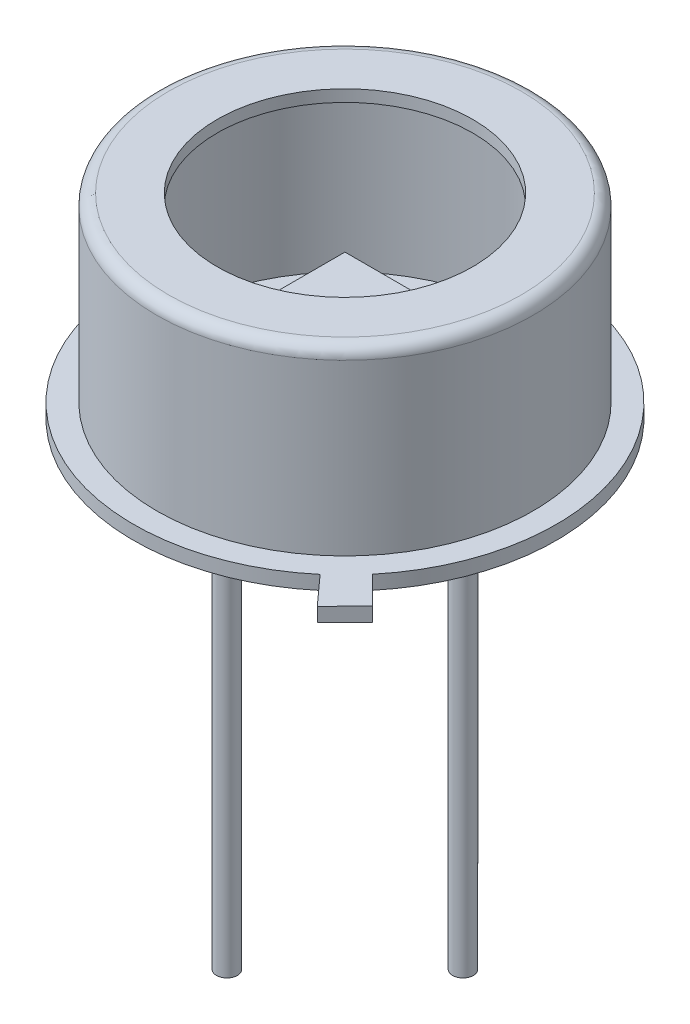
ISO-10303-21;
HEADER;
FILE_DESCRIPTION(('STEP AP214'),'2;1');
FILE_NAME('part.step','',(''),(''),'','','');
FILE_SCHEMA(('AUTOMOTIVE_DESIGN { 1 0 10303 214 1 1 1 1 }'));
ENDSEC;
DATA;
#1=APPLICATION_CONTEXT('core data for automotive mechanical design processes');
#2=APPLICATION_PROTOCOL_DEFINITION('international standard','automotive_design',2000,#1);
#3=PRODUCT_CONTEXT('',#1,'mechanical');
#4=PRODUCT('Part','Part','',(#3));
#5=PRODUCT_RELATED_PRODUCT_CATEGORY('part','',(#4));
#6=PRODUCT_DEFINITION_FORMATION('','',#4);
#7=PRODUCT_DEFINITION_CONTEXT('part definition',#1,'design');
#8=PRODUCT_DEFINITION('design','',#6,#7);
#9=PRODUCT_DEFINITION_SHAPE('','',#8);
#10=(LENGTH_UNIT() NAMED_UNIT(*) SI_UNIT(.MILLI.,.METRE.));
#11=(NAMED_UNIT(*) PLANE_ANGLE_UNIT() SI_UNIT($,.RADIAN.));
#12=(NAMED_UNIT(*) SI_UNIT($,.STERADIAN.) SOLID_ANGLE_UNIT());
#13=UNCERTAINTY_MEASURE_WITH_UNIT(LENGTH_MEASURE(1.E-05),#10,'distance_accuracy_value','');
#14=(GEOMETRIC_REPRESENTATION_CONTEXT(3) GLOBAL_UNCERTAINTY_ASSIGNED_CONTEXT((#13)) GLOBAL_UNIT_ASSIGNED_CONTEXT((#10,
#11,#12)) REPRESENTATION_CONTEXT('',''));
#15=CARTESIAN_POINT('',(0.,0.,0.));
#16=DIRECTION('',(0.,0.,1.));
#17=DIRECTION('',(1.,0.,0.));
#18=AXIS2_PLACEMENT_3D('',#15,#16,#17);
#19=CARTESIAN_POINT('',(-1.,1.592,1.));
#20=DIRECTION('',(1.,0.,0.));
#21=DIRECTION('',(0.,0.,-1.));
#22=AXIS2_PLACEMENT_3D('',#19,#20,#21);
#23=PLANE('',#22);
#24=DIRECTION('',(0.,0.,-1.));
#25=VECTOR('',#24,1.);
#26=CARTESIAN_POINT('',(-1.,2.1,1.));
#27=LINE('',#26,#25);
#28=CARTESIAN_POINT('',(-1.,2.1,1.));
#29=VERTEX_POINT('',#28);
#30=CARTESIAN_POINT('',(-1.,2.1,-1.));
#31=VERTEX_POINT('',#30);
#32=EDGE_CURVE('E108',#29,#31,#27,.T.);
#33=ORIENTED_EDGE('',*,*,#32,.T.);
#34=DIRECTION('',(0.,1.,0.));
#35=VECTOR('',#34,1.);
#36=CARTESIAN_POINT('',(-1.,1.592,-1.));
#37=LINE('',#36,#35);
#38=CARTESIAN_POINT('',(-1.,1.592,-1.));
#39=VERTEX_POINT('',#38);
#40=EDGE_CURVE('E12',#39,#31,#37,.T.);
#41=ORIENTED_EDGE('',*,*,#40,.F.);
#42=DIRECTION('',(0.,0.,-1.));
#43=VECTOR('',#42,1.);
#44=CARTESIAN_POINT('',(-1.,1.592,1.));
#45=LINE('',#44,#43);
#46=CARTESIAN_POINT('',(-1.,1.592,1.));
#47=VERTEX_POINT('',#46);
#48=EDGE_CURVE('E96',#47,#39,#45,.T.);
#49=ORIENTED_EDGE('',*,*,#48,.F.);
#50=DIRECTION('',(0.,1.,0.));
#51=VECTOR('',#50,1.);
#52=CARTESIAN_POINT('',(-1.,1.592,1.));
#53=LINE('',#52,#51);
#54=EDGE_CURVE('E104',#47,#29,#53,.T.);
#55=ORIENTED_EDGE('',*,*,#54,.T.);
#56=EDGE_LOOP('',(#33,#41,#49,#55));
#57=FACE_BOUND('',#56,.T.);
#58=ADVANCED_FACE('F45',(#57),#23,.F.);
#59=CARTESIAN_POINT('',(-1.,1.592,-1.));
#60=DIRECTION('',(0.,0.,1.));
#61=DIRECTION('',(1.,0.,0.));
#62=AXIS2_PLACEMENT_3D('',#59,#60,#61);
#63=PLANE('',#62);
#64=DIRECTION('',(1.,0.,0.));
#65=VECTOR('',#64,1.);
#66=CARTESIAN_POINT('',(-1.,2.1,-1.));
#67=LINE('',#66,#65);
#68=CARTESIAN_POINT('',(1.,2.1,-1.));
#69=VERTEX_POINT('',#68);
#70=EDGE_CURVE('E100',#31,#69,#67,.T.);
#71=ORIENTED_EDGE('',*,*,#70,.T.);
#72=DIRECTION('',(0.,1.,0.));
#73=VECTOR('',#72,1.);
#74=CARTESIAN_POINT('',(1.,1.592,-1.));
#75=LINE('',#74,#73);
#76=CARTESIAN_POINT('',(1.,1.592,-1.));
#77=VERTEX_POINT('',#76);
#78=EDGE_CURVE('E53',#77,#69,#75,.T.);
#79=ORIENTED_EDGE('',*,*,#78,.F.);
#80=DIRECTION('',(1.,0.,0.));
#81=VECTOR('',#80,1.);
#82=CARTESIAN_POINT('',(-1.,1.592,-1.));
#83=LINE('',#82,#81);
#84=EDGE_CURVE('E91',#39,#77,#83,.T.);
#85=ORIENTED_EDGE('',*,*,#84,.F.);
#86=ORIENTED_EDGE('',*,*,#40,.T.);
#87=EDGE_LOOP('',(#71,#79,#85,#86));
#88=FACE_BOUND('',#87,.T.);
#89=ADVANCED_FACE('F99',(#88),#63,.F.);
#90=CARTESIAN_POINT('',(1.,1.592,1.));
#91=DIRECTION('',(-1.,0.,0.));
#92=DIRECTION('',(0.,0.,1.));
#93=AXIS2_PLACEMENT_3D('',#90,#91,#92);
#94=PLANE('',#93);
#95=DIRECTION('',(0.,0.,1.));
#96=VECTOR('',#95,1.);
#97=CARTESIAN_POINT('',(1.,2.1,1.));
#98=LINE('',#97,#96);
#99=CARTESIAN_POINT('',(1.,2.1,1.));
#100=VERTEX_POINT('',#99);
#101=EDGE_CURVE('E78',#69,#100,#98,.T.);
#102=ORIENTED_EDGE('',*,*,#101,.T.);
#103=DIRECTION('',(0.,1.,0.));
#104=VECTOR('',#103,1.);
#105=CARTESIAN_POINT('',(1.,1.592,1.));
#106=LINE('',#105,#104);
#107=CARTESIAN_POINT('',(1.,1.592,1.));
#108=VERTEX_POINT('',#107);
#109=EDGE_CURVE('E101',#108,#100,#106,.T.);
#110=ORIENTED_EDGE('',*,*,#109,.F.);
#111=DIRECTION('',(0.,0.,1.));
#112=VECTOR('',#111,1.);
#113=CARTESIAN_POINT('',(1.,1.592,1.));
#114=LINE('',#113,#112);
#115=EDGE_CURVE('E94',#77,#108,#114,.T.);
#116=ORIENTED_EDGE('',*,*,#115,.F.);
#117=ORIENTED_EDGE('',*,*,#78,.T.);
#118=EDGE_LOOP('',(#102,#110,#116,#117));
#119=FACE_BOUND('',#118,.T.);
#120=ADVANCED_FACE('F102',(#119),#94,.F.);
#121=CARTESIAN_POINT('',(-1.,1.592,1.));
#122=DIRECTION('',(0.,0.,-1.));
#123=DIRECTION('',(-1.,0.,0.));
#124=AXIS2_PLACEMENT_3D('',#121,#122,#123);
#125=PLANE('',#124);
#126=DIRECTION('',(-1.,0.,0.));
#127=VECTOR('',#126,1.);
#128=CARTESIAN_POINT('',(-1.,2.1,1.));
#129=LINE('',#128,#127);
#130=EDGE_CURVE('E84',#100,#29,#129,.T.);
#131=ORIENTED_EDGE('',*,*,#130,.T.);
#132=ORIENTED_EDGE('',*,*,#54,.F.);
#133=DIRECTION('',(-1.,0.,0.));
#134=VECTOR('',#133,1.);
#135=CARTESIAN_POINT('',(-1.,1.592,1.));
#136=LINE('',#135,#134);
#137=EDGE_CURVE('E61',#108,#47,#136,.T.);
#138=ORIENTED_EDGE('',*,*,#137,.F.);
#139=ORIENTED_EDGE('',*,*,#109,.T.);
#140=EDGE_LOOP('',(#131,#132,#138,#139));
#141=FACE_BOUND('',#140,.T.);
#142=ADVANCED_FACE('F115',(#141),#125,.F.);
#143=CARTESIAN_POINT('',(-1.,1.592,-1.));
#144=DIRECTION('',(0.,-1.,0.));
#145=DIRECTION('',(0.,0.,-1.));
#146=AXIS2_PLACEMENT_3D('',#143,#144,#145);
#147=PLANE('',#146);
#148=ORIENTED_EDGE('',*,*,#48,.T.);
#149=ORIENTED_EDGE('',*,*,#84,.T.);
#150=ORIENTED_EDGE('',*,*,#115,.T.);
#151=ORIENTED_EDGE('',*,*,#137,.T.);
#152=EDGE_LOOP('',(#148,#149,#150,#151));
#153=FACE_BOUND('',#152,.T.);
#154=ADVANCED_FACE('F92',(#153),#147,.T.);
#155=CARTESIAN_POINT('',(-1.,2.1,-1.));
#156=DIRECTION('',(0.,-1.,0.));
#157=DIRECTION('',(0.,0.,-1.));
#158=AXIS2_PLACEMENT_3D('',#155,#156,#157);
#159=PLANE('',#158);
#160=ORIENTED_EDGE('',*,*,#32,.F.);
#161=ORIENTED_EDGE('',*,*,#130,.F.);
#162=ORIENTED_EDGE('',*,*,#101,.F.);
#163=ORIENTED_EDGE('',*,*,#70,.F.);
#164=EDGE_LOOP('',(#160,#161,#162,#163));
#165=FACE_BOUND('',#164,.T.);
#166=ADVANCED_FACE('F118',(#165),#159,.F.);
#167=CLOSED_SHELL('',(#58,#89,#120,#142,#154,#166));
#168=MANIFOLD_SOLID_BREP('B2',#167);
#169=CARTESIAN_POINT('',(4.55,0.,0.));
#170=DIRECTION('',(0.,1.,0.));
#171=DIRECTION('',(0.,0.,1.));
#172=AXIS2_PLACEMENT_3D('',#169,#170,#171);
#173=PLANE('',#172);
#174=CARTESIAN_POINT('',(2.54,0.,0.));
#175=DIRECTION('',(0.,1.,0.));
#176=DIRECTION('',(0.,0.,1.));
#177=AXIS2_PLACEMENT_3D('',#174,#175,#176);
#178=CIRCLE('',#177,0.225000000000001);
#179=CARTESIAN_POINT('',(2.54,0.,0.225000000000001));
#180=VERTEX_POINT('',#179);
#181=EDGE_CURVE('E179',#180,#180,#178,.F.);
#182=ORIENTED_EDGE('',*,*,#181,.F.);
#183=EDGE_LOOP('',(#182));
#184=FACE_BOUND('',#183,.T.);
#185=CARTESIAN_POINT('',(-2.54,0.,0.));
#186=DIRECTION('',(0.,1.,0.));
#187=DIRECTION('',(0.,0.,1.));
#188=AXIS2_PLACEMENT_3D('',#185,#186,#187);
#189=CIRCLE('',#188,0.224999999999999);
#190=CARTESIAN_POINT('',(-2.54,0.,0.224999999999999));
#191=VERTEX_POINT('',#190);
#192=EDGE_CURVE('E269',#191,#191,#189,.F.);
#193=ORIENTED_EDGE('',*,*,#192,.F.);
#194=EDGE_LOOP('',(#193));
#195=FACE_BOUND('',#194,.T.);
#196=CARTESIAN_POINT('',(0.,0.,0.));
#197=DIRECTION('',(0.,-1.,0.));
#198=DIRECTION('',(0.,0.,-1.));
#199=AXIS2_PLACEMENT_3D('',#196,#197,#198);
#200=CIRCLE('',#199,4.55);
#201=CARTESIAN_POINT('',(2.93886579784095,0.,3.47355262264453));
#202=VERTEX_POINT('',#201);
#203=CARTESIAN_POINT('',(3.4991505641407,0.,2.90834064880197));
#204=VERTEX_POINT('',#203);
#205=EDGE_CURVE('E186',#202,#204,#200,.T.);
#206=ORIENTED_EDGE('',*,*,#205,.T.);
#207=DIRECTION('',(0.710195552739869,0.,0.70400445798909));
#208=VECTOR('',#207,1.);
#209=CARTESIAN_POINT('',(3.4991505641407,0.,2.90834064880197));
#210=LINE('',#209,#208);
#211=CARTESIAN_POINT('',(4.09684665660265,0.,3.50082635501703));
#212=VERTEX_POINT('',#211);
#213=EDGE_CURVE('E239',#204,#212,#210,.T.);
#214=ORIENTED_EDGE('',*,*,#213,.T.);
#215=DIRECTION('',(-0.70400445798909,0.,0.710195552739869));
#216=VECTOR('',#215,1.);
#217=CARTESIAN_POINT('',(4.09684665660265,0.,3.50082635501703));
#218=LINE('',#217,#216);
#219=CARTESIAN_POINT('',(3.50343561688417,0.,4.09945591846979));
#220=VERTEX_POINT('',#219);
#221=EDGE_CURVE('E235',#212,#220,#218,.T.);
#222=ORIENTED_EDGE('',*,*,#221,.T.);
#223=DIRECTION('',(-0.669788128042024,0.,-0.742552263166682));
#224=VECTOR('',#223,1.);
#225=CARTESIAN_POINT('',(3.50343561688417,0.,4.09945591846979));
#226=LINE('',#225,#224);
#227=EDGE_CURVE('E226',#220,#202,#226,.T.);
#228=ORIENTED_EDGE('',*,*,#227,.T.);
#229=EDGE_LOOP('',(#206,#214,#222,#228));
#230=FACE_BOUND('',#229,.T.);
#231=CARTESIAN_POINT('',(0.,0.,2.54));
#232=DIRECTION('',(0.,1.,0.));
#233=DIRECTION('',(0.,0.,1.));
#234=AXIS2_PLACEMENT_3D('',#231,#232,#233);
#235=CIRCLE('',#234,0.75);
#236=CARTESIAN_POINT('',(0.,0.,3.29));
#237=VERTEX_POINT('',#236);
#238=EDGE_CURVE('E43',#237,#237,#235,.F.);
#239=ORIENTED_EDGE('',*,*,#238,.F.);
#240=EDGE_LOOP('',(#239));
#241=FACE_BOUND('',#240,.T.);
#242=ADVANCED_FACE('F171',(#184,#195,#230,#241),#173,.F.);
#243=CARTESIAN_POINT('',(3.796,4.2,0.));
#244=DIRECTION('',(0.,1.,0.));
#245=DIRECTION('',(0.,0.,1.));
#246=AXIS2_PLACEMENT_3D('',#243,#244,#245);
#247=PLANE('',#246);
#248=CARTESIAN_POINT('',(0.,4.2,0.));
#249=DIRECTION('',(0.,-1.,0.));
#250=DIRECTION('',(0.,0.,-1.));
#251=AXIS2_PLACEMENT_3D('',#248,#249,#250);
#252=CIRCLE('',#251,2.75);
#253=CARTESIAN_POINT('',(0.,4.2,-2.75));
#254=VERTEX_POINT('',#253);
#255=EDGE_CURVE('E266',#254,#254,#252,.T.);
#256=ORIENTED_EDGE('',*,*,#255,.T.);
#257=EDGE_LOOP('',(#256));
#258=FACE_BOUND('',#257,.T.);
#259=CARTESIAN_POINT('',(0.,4.2,0.));
#260=DIRECTION('',(0.,-1.,0.));
#261=DIRECTION('',(0.,0.,-1.));
#262=AXIS2_PLACEMENT_3D('',#259,#260,#261);
#263=CIRCLE('',#262,3.796);
#264=CARTESIAN_POINT('',(0.,4.2,-3.796));
#265=VERTEX_POINT('',#264);
#266=EDGE_CURVE('E249',#265,#265,#263,.T.);
#267=ORIENTED_EDGE('',*,*,#266,.F.);
#268=EDGE_LOOP('',(#267));
#269=FACE_BOUND('',#268,.T.);
#270=ADVANCED_FACE('F173',(#258,#269),#247,.T.);
#271=CARTESIAN_POINT('',(0.,0.,0.));
#272=DIRECTION('',(0.,-1.,0.));
#273=DIRECTION('',(0.,0.,-1.));
#274=AXIS2_PLACEMENT_3D('',#271,#272,#273);
#275=CYLINDRICAL_SURFACE('',#274,2.75);
#276=ORIENTED_EDGE('',*,*,#255,.F.);
#277=EDGE_LOOP('',(#276));
#278=FACE_BOUND('',#277,.T.);
#279=CARTESIAN_POINT('',(0.,3.946,0.));
#280=DIRECTION('',(0.,-1.,0.));
#281=DIRECTION('',(0.,0.,-1.));
#282=AXIS2_PLACEMENT_3D('',#279,#280,#281);
#283=CIRCLE('',#282,2.75);
#284=CARTESIAN_POINT('',(0.,3.946,-2.75));
#285=VERTEX_POINT('',#284);
#286=EDGE_CURVE('E263',#285,#285,#283,.T.);
#287=ORIENTED_EDGE('',*,*,#286,.T.);
#288=EDGE_LOOP('',(#287));
#289=FACE_BOUND('',#288,.T.);
#290=ADVANCED_FACE('F314',(#278,#289),#275,.F.);
#291=CARTESIAN_POINT('',(3.796,3.946,0.));
#292=DIRECTION('',(0.,1.,0.));
#293=DIRECTION('',(0.,0.,1.));
#294=AXIS2_PLACEMENT_3D('',#291,#292,#293);
#295=PLANE('',#294);
#296=ORIENTED_EDGE('',*,*,#286,.F.);
#297=EDGE_LOOP('',(#296));
#298=FACE_BOUND('',#297,.T.);
#299=CARTESIAN_POINT('',(0.,3.946,0.));
#300=DIRECTION('',(0.,-1.,0.));
#301=DIRECTION('',(0.,0.,-1.));
#302=AXIS2_PLACEMENT_3D('',#299,#300,#301);
#303=CIRCLE('',#302,3.796);
#304=CARTESIAN_POINT('',(0.,3.946,-3.796));
#305=VERTEX_POINT('',#304);
#306=EDGE_CURVE('E260',#305,#305,#303,.T.);
#307=ORIENTED_EDGE('',*,*,#306,.T.);
#308=EDGE_LOOP('',(#307));
#309=FACE_BOUND('',#308,.T.);
#310=ADVANCED_FACE('F325',(#298,#309),#295,.F.);
#311=CARTESIAN_POINT('',(0.,0.,0.));
#312=DIRECTION('',(0.,-1.,0.));
#313=DIRECTION('',(0.,0.,-1.));
#314=AXIS2_PLACEMENT_3D('',#311,#312,#313);
#315=CYLINDRICAL_SURFACE('',#314,3.796);
#316=ORIENTED_EDGE('',*,*,#306,.F.);
#317=EDGE_LOOP('',(#316));
#318=FACE_BOUND('',#317,.T.);
#319=CARTESIAN_POINT('',(0.,0.0459999999999999,0.));
#320=DIRECTION('',(0.,1.,0.));
#321=DIRECTION('',(0.,0.,1.));
#322=AXIS2_PLACEMENT_3D('',#319,#320,#321);
#323=CIRCLE('',#322,3.796);
#324=CARTESIAN_POINT('',(0.,0.0459999999999999,3.796));
#325=VERTEX_POINT('',#324);
#326=EDGE_CURVE('E246',#325,#325,#323,.F.);
#327=ORIENTED_EDGE('',*,*,#326,.T.);
#328=EDGE_LOOP('',(#327));
#329=FACE_BOUND('',#328,.T.);
#330=ADVANCED_FACE('F322',(#318,#329),#315,.F.);
#331=CARTESIAN_POINT('',(0.,0.,0.));
#332=DIRECTION('',(0.,-1.,0.));
#333=DIRECTION('',(0.,0.,-1.));
#334=AXIS2_PLACEMENT_3D('',#331,#332,#333);
#335=CYLINDRICAL_SURFACE('',#334,4.55);
#336=DIRECTION('',(0.,-1.,0.));
#337=VECTOR('',#336,1.);
#338=CARTESIAN_POINT('',(2.93886579784096,1.96122703291704,3.47355262264452));
#339=LINE('',#338,#337);
#340=CARTESIAN_POINT('',(2.93886579784097,0.3,3.47355262264451));
#341=VERTEX_POINT('',#340);
#342=EDGE_CURVE('E220',#341,#202,#339,.T.);
#343=ORIENTED_EDGE('',*,*,#342,.F.);
#344=CARTESIAN_POINT('',(0.,0.3,0.));
#345=DIRECTION('',(0.,-1.,0.));
#346=DIRECTION('',(0.,0.,-1.));
#347=AXIS2_PLACEMENT_3D('',#344,#345,#346);
#348=CIRCLE('',#347,4.55);
#349=CARTESIAN_POINT('',(3.4991505641407,0.3,2.90834064880197));
#350=VERTEX_POINT('',#349);
#351=EDGE_CURVE('E218',#341,#350,#348,.T.);
#352=ORIENTED_EDGE('',*,*,#351,.T.);
#353=DIRECTION('',(0.,-1.,0.));
#354=VECTOR('',#353,1.);
#355=CARTESIAN_POINT('',(3.4991505641407,1.96122703291704,2.90834064880197));
#356=LINE('',#355,#354);
#357=EDGE_CURVE('E191',#350,#204,#356,.T.);
#358=ORIENTED_EDGE('',*,*,#357,.T.);
#359=ORIENTED_EDGE('',*,*,#205,.F.);
#360=EDGE_LOOP('',(#343,#352,#358,#359));
#361=FACE_BOUND('',#360,.T.);
#362=ADVANCED_FACE('F320',(#361),#335,.T.);
#363=CARTESIAN_POINT('',(4.55,0.3,0.));
#364=DIRECTION('',(0.,1.,0.));
#365=DIRECTION('',(0.,0.,1.));
#366=AXIS2_PLACEMENT_3D('',#363,#364,#365);
#367=PLANE('',#366);
#368=ORIENTED_EDGE('',*,*,#351,.F.);
#369=DIRECTION('',(-0.669788128042024,0.,-0.742552263166682));
#370=VECTOR('',#369,1.);
#371=CARTESIAN_POINT('',(3.50343561688417,0.3,4.09945591846979));
#372=LINE('',#371,#370);
#373=CARTESIAN_POINT('',(3.50343561688417,0.3,4.09945591846979));
#374=VERTEX_POINT('',#373);
#375=EDGE_CURVE('E210',#374,#341,#372,.T.);
#376=ORIENTED_EDGE('',*,*,#375,.F.);
#377=DIRECTION('',(-0.70400445798909,0.,0.710195552739869));
#378=VECTOR('',#377,1.);
#379=CARTESIAN_POINT('',(4.09684665660265,0.3,3.50082635501703));
#380=LINE('',#379,#378);
#381=CARTESIAN_POINT('',(4.09684665660265,0.3,3.50082635501703));
#382=VERTEX_POINT('',#381);
#383=EDGE_CURVE('E216',#382,#374,#380,.T.);
#384=ORIENTED_EDGE('',*,*,#383,.F.);
#385=DIRECTION('',(0.710195552739869,0.,0.70400445798909));
#386=VECTOR('',#385,1.);
#387=CARTESIAN_POINT('',(3.4991505641407,0.3,2.90834064880197));
#388=LINE('',#387,#386);
#389=EDGE_CURVE('E241',#350,#382,#388,.T.);
#390=ORIENTED_EDGE('',*,*,#389,.F.);
#391=EDGE_LOOP('',(#368,#376,#384,#390));
#392=FACE_BOUND('',#391,.T.);
#393=CARTESIAN_POINT('',(0.,0.3,0.));
#394=DIRECTION('',(0.,-1.,0.));
#395=DIRECTION('',(0.,0.,-1.));
#396=AXIS2_PLACEMENT_3D('',#393,#394,#395);
#397=CIRCLE('',#396,4.05);
#398=CARTESIAN_POINT('',(0.,0.3,-4.05));
#399=VERTEX_POINT('',#398);
#400=EDGE_CURVE('E255',#399,#399,#397,.T.);
#401=ORIENTED_EDGE('',*,*,#400,.T.);
#402=EDGE_LOOP('',(#401));
#403=FACE_BOUND('',#402,.T.);
#404=ADVANCED_FACE('F212',(#392,#403),#367,.T.);
#405=CARTESIAN_POINT('',(0.,0.,0.));
#406=DIRECTION('',(0.,-1.,0.));
#407=DIRECTION('',(0.,0.,-1.));
#408=AXIS2_PLACEMENT_3D('',#405,#406,#407);
#409=CYLINDRICAL_SURFACE('',#408,4.05);
#410=CARTESIAN_POINT('',(0.,3.946,0.));
#411=DIRECTION('',(0.,-1.,0.));
#412=DIRECTION('',(0.,0.,-1.));
#413=AXIS2_PLACEMENT_3D('',#410,#411,#412);
#414=CIRCLE('',#413,4.05);
#415=CARTESIAN_POINT('',(0.,3.946,-4.05));
#416=VERTEX_POINT('',#415);
#417=EDGE_CURVE('E252',#416,#416,#414,.T.);
#418=ORIENTED_EDGE('',*,*,#417,.T.);
#419=EDGE_LOOP('',(#418));
#420=FACE_BOUND('',#419,.T.);
#421=ORIENTED_EDGE('',*,*,#400,.F.);
#422=EDGE_LOOP('',(#421));
#423=FACE_BOUND('',#422,.T.);
#424=ADVANCED_FACE('F350',(#420,#423),#409,.T.);
#425=CARTESIAN_POINT('',(0.,3.946,0.));
#426=DIRECTION('',(0.,-1.,0.));
#427=DIRECTION('',(0.,0.,-1.));
#428=AXIS2_PLACEMENT_3D('',#425,#426,#427);
#429=TOROIDAL_SURFACE('',#428,3.796,0.253999999999999);
#430=ORIENTED_EDGE('',*,*,#266,.T.);
#431=EDGE_LOOP('',(#430));
#432=FACE_BOUND('',#431,.T.);
#433=ORIENTED_EDGE('',*,*,#417,.F.);
#434=EDGE_LOOP('',(#433));
#435=FACE_BOUND('',#434,.T.);
#436=ADVANCED_FACE('F343',(#432,#435),#429,.T.);
#437=CARTESIAN_POINT('',(4.55,0.0459999999999999,0.));
#438=DIRECTION('',(0.,1.,0.));
#439=DIRECTION('',(0.,0.,1.));
#440=AXIS2_PLACEMENT_3D('',#437,#438,#439);
#441=PLANE('',#440);
#442=ORIENTED_EDGE('',*,*,#326,.F.);
#443=EDGE_LOOP('',(#442));
#444=FACE_BOUND('',#443,.T.);
#445=ADVANCED_FACE('F341',(#444),#441,.T.);
#446=CARTESIAN_POINT('',(4.09684665660265,1.96122703291704,3.50082635501703));
#447=DIRECTION('',(0.710195552739869,0.,0.70400445798909));
#448=DIRECTION('',(0.70400445798909,0.,-0.710195552739869));
#449=AXIS2_PLACEMENT_3D('',#446,#447,#448);
#450=PLANE('',#449);
#451=DIRECTION('',(0.,-1.,0.));
#452=VECTOR('',#451,1.);
#453=CARTESIAN_POINT('',(4.09684665660265,1.96122703291704,3.50082635501703));
#454=LINE('',#453,#452);
#455=EDGE_CURVE('E233',#382,#212,#454,.T.);
#456=ORIENTED_EDGE('',*,*,#455,.F.);
#457=ORIENTED_EDGE('',*,*,#383,.T.);
#458=DIRECTION('',(0.,-1.,0.));
#459=VECTOR('',#458,1.);
#460=CARTESIAN_POINT('',(3.50343561688417,1.96122703291704,4.09945591846979));
#461=LINE('',#460,#459);
#462=EDGE_CURVE('E221',#374,#220,#461,.T.);
#463=ORIENTED_EDGE('',*,*,#462,.T.);
#464=ORIENTED_EDGE('',*,*,#221,.F.);
#465=EDGE_LOOP('',(#456,#457,#463,#464));
#466=FACE_BOUND('',#465,.T.);
#467=ADVANCED_FACE('F232',(#466),#450,.T.);
#468=CARTESIAN_POINT('',(3.50343561688417,1.96122703291704,4.09945591846979));
#469=DIRECTION('',(-0.742552263166682,0.,0.669788128042024));
#470=DIRECTION('',(0.669788128042024,0.,0.742552263166682));
#471=AXIS2_PLACEMENT_3D('',#468,#469,#470);
#472=PLANE('',#471);
#473=ORIENTED_EDGE('',*,*,#462,.F.);
#474=ORIENTED_EDGE('',*,*,#375,.T.);
#475=ORIENTED_EDGE('',*,*,#342,.T.);
#476=ORIENTED_EDGE('',*,*,#227,.F.);
#477=EDGE_LOOP('',(#473,#474,#475,#476));
#478=FACE_BOUND('',#477,.T.);
#479=ADVANCED_FACE('F224',(#478),#472,.T.);
#480=CARTESIAN_POINT('',(3.4991505641407,1.96122703291704,2.90834064880197));
#481=DIRECTION('',(0.70400445798909,0.,-0.710195552739869));
#482=DIRECTION('',(-0.710195552739869,0.,-0.70400445798909));
#483=AXIS2_PLACEMENT_3D('',#480,#481,#482);
#484=PLANE('',#483);
#485=ORIENTED_EDGE('',*,*,#357,.F.);
#486=ORIENTED_EDGE('',*,*,#389,.T.);
#487=ORIENTED_EDGE('',*,*,#455,.T.);
#488=ORIENTED_EDGE('',*,*,#213,.F.);
#489=EDGE_LOOP('',(#485,#486,#487,#488));
#490=FACE_BOUND('',#489,.T.);
#491=ADVANCED_FACE('F296',(#490),#484,.T.);
#492=CARTESIAN_POINT('',(-2.54,-9.,0.));
#493=DIRECTION('',(0.,1.,0.));
#494=DIRECTION('',(0.,0.,1.));
#495=AXIS2_PLACEMENT_3D('',#492,#493,#494);
#496=CYLINDRICAL_SURFACE('',#495,0.224999999999999);
#497=CARTESIAN_POINT('',(-2.54,-9.,0.));
#498=DIRECTION('',(0.,-1.,0.));
#499=DIRECTION('',(0.,0.,-1.));
#500=AXIS2_PLACEMENT_3D('',#497,#498,#499);
#501=CIRCLE('',#500,0.224999999999999);
#502=CARTESIAN_POINT('',(-2.54,-9.,-0.224999999999999));
#503=VERTEX_POINT('',#502);
#504=EDGE_CURVE('E289',#503,#503,#501,.T.);
#505=ORIENTED_EDGE('',*,*,#504,.F.);
#506=EDGE_LOOP('',(#505));
#507=FACE_BOUND('',#506,.T.);
#508=ORIENTED_EDGE('',*,*,#192,.T.);
#509=EDGE_LOOP('',(#508));
#510=FACE_BOUND('',#509,.T.);
#511=ADVANCED_FACE('F298',(#507,#510),#496,.T.);
#512=CARTESIAN_POINT('',(-2.54,-9.,0.));
#513=DIRECTION('',(0.,-1.,0.));
#514=DIRECTION('',(0.,0.,-1.));
#515=AXIS2_PLACEMENT_3D('',#512,#513,#514);
#516=PLANE('',#515);
#517=ORIENTED_EDGE('',*,*,#504,.T.);
#518=EDGE_LOOP('',(#517));
#519=FACE_BOUND('',#518,.T.);
#520=ADVANCED_FACE('F304',(#519),#516,.T.);
#521=CARTESIAN_POINT('',(2.54,-9.,0.));
#522=DIRECTION('',(0.,1.,0.));
#523=DIRECTION('',(0.,0.,1.));
#524=AXIS2_PLACEMENT_3D('',#521,#522,#523);
#525=CYLINDRICAL_SURFACE('',#524,0.225000000000001);
#526=CARTESIAN_POINT('',(2.54,-9.,0.));
#527=DIRECTION('',(0.,-1.,0.));
#528=DIRECTION('',(0.,0.,-1.));
#529=AXIS2_PLACEMENT_3D('',#526,#527,#528);
#530=CIRCLE('',#529,0.225000000000001);
#531=CARTESIAN_POINT('',(2.54,-9.,-0.225000000000001));
#532=VERTEX_POINT('',#531);
#533=EDGE_CURVE('E280',#532,#532,#530,.T.);
#534=ORIENTED_EDGE('',*,*,#533,.F.);
#535=EDGE_LOOP('',(#534));
#536=FACE_BOUND('',#535,.T.);
#537=ORIENTED_EDGE('',*,*,#181,.T.);
#538=EDGE_LOOP('',(#537));
#539=FACE_BOUND('',#538,.T.);
#540=ADVANCED_FACE('F438',(#536,#539),#525,.T.);
#541=CARTESIAN_POINT('',(2.54,-9.,0.));
#542=DIRECTION('',(0.,-1.,0.));
#543=DIRECTION('',(0.,0.,-1.));
#544=AXIS2_PLACEMENT_3D('',#541,#542,#543);
#545=PLANE('',#544);
#546=ORIENTED_EDGE('',*,*,#533,.T.);
#547=EDGE_LOOP('',(#546));
#548=FACE_BOUND('',#547,.T.);
#549=ADVANCED_FACE('F447',(#548),#545,.T.);
#550=CARTESIAN_POINT('',(0.,-0.4,2.54));
#551=DIRECTION('',(0.,-1.,0.));
#552=DIRECTION('',(0.,0.,-1.));
#553=AXIS2_PLACEMENT_3D('',#550,#551,#552);
#554=PLANE('',#553);
#555=CARTESIAN_POINT('',(0.,-0.4,2.54));
#556=DIRECTION('',(0.,-1.,0.));
#557=DIRECTION('',(0.,0.,-1.));
#558=AXIS2_PLACEMENT_3D('',#555,#556,#557);
#559=CIRCLE('',#558,0.75);
#560=CARTESIAN_POINT('',(0.,-0.4,1.79));
#561=VERTEX_POINT('',#560);
#562=EDGE_CURVE('E276',#561,#561,#559,.T.);
#563=ORIENTED_EDGE('',*,*,#562,.T.);
#564=EDGE_LOOP('',(#563));
#565=FACE_BOUND('',#564,.T.);
#566=CARTESIAN_POINT('',(0.,-0.399999999999999,2.54));
#567=DIRECTION('',(0.,-1.,0.));
#568=DIRECTION('',(0.,0.,-1.));
#569=AXIS2_PLACEMENT_3D('',#566,#567,#568);
#570=CIRCLE('',#569,0.225000000000001);
#571=CARTESIAN_POINT('',(0.,-0.399999999999999,2.315));
#572=VERTEX_POINT('',#571);
#573=EDGE_CURVE('E273',#572,#572,#570,.T.);
#574=ORIENTED_EDGE('',*,*,#573,.F.);
#575=EDGE_LOOP('',(#574));
#576=FACE_BOUND('',#575,.T.);
#577=ADVANCED_FACE('F456',(#565,#576),#554,.T.);
#578=CARTESIAN_POINT('',(0.,-0.4,2.54));
#579=DIRECTION('',(0.,1.,0.));
#580=DIRECTION('',(0.,0.,1.));
#581=AXIS2_PLACEMENT_3D('',#578,#579,#580);
#582=CYLINDRICAL_SURFACE('',#581,0.75);
#583=ORIENTED_EDGE('',*,*,#562,.F.);
#584=EDGE_LOOP('',(#583));
#585=FACE_BOUND('',#584,.T.);
#586=ORIENTED_EDGE('',*,*,#238,.T.);
#587=EDGE_LOOP('',(#586));
#588=FACE_BOUND('',#587,.T.);
#589=ADVANCED_FACE('F475',(#585,#588),#582,.T.);
#590=CARTESIAN_POINT('',(0.,-9.,2.54));
#591=DIRECTION('',(0.,-1.,0.));
#592=DIRECTION('',(0.,0.,-1.));
#593=AXIS2_PLACEMENT_3D('',#590,#591,#592);
#594=PLANE('',#593);
#595=CARTESIAN_POINT('',(0.,-9.,2.54));
#596=DIRECTION('',(0.,-1.,0.));
#597=DIRECTION('',(0.,0.,-1.));
#598=AXIS2_PLACEMENT_3D('',#595,#596,#597);
#599=CIRCLE('',#598,0.225000000000001);
#600=CARTESIAN_POINT('',(0.,-9.,2.315));
#601=VERTEX_POINT('',#600);
#602=EDGE_CURVE('E275',#601,#601,#599,.T.);
#603=ORIENTED_EDGE('',*,*,#602,.T.);
#604=EDGE_LOOP('',(#603));
#605=FACE_BOUND('',#604,.T.);
#606=ADVANCED_FACE('F467',(#605),#594,.T.);
#607=CARTESIAN_POINT('',(0.,-9.,2.54));
#608=DIRECTION('',(0.,1.,0.));
#609=DIRECTION('',(0.,0.,1.));
#610=AXIS2_PLACEMENT_3D('',#607,#608,#609);
#611=CYLINDRICAL_SURFACE('',#610,0.225000000000001);
#612=ORIENTED_EDGE('',*,*,#573,.T.);
#613=EDGE_LOOP('',(#612));
#614=FACE_BOUND('',#613,.T.);
#615=ORIENTED_EDGE('',*,*,#602,.F.);
#616=EDGE_LOOP('',(#615));
#617=FACE_BOUND('',#616,.T.);
#618=ADVANCED_FACE('F461',(#614,#617),#611,.T.);
#619=CLOSED_SHELL('',(#242,#270,#290,#310,#330,#362,#404,#424,#436,#445,#467,#479,#491,#511,
#520,#540,#549,#577,#589,#606,#618));
#620=MANIFOLD_SOLID_BREP('B6',#619);
#621=ADVANCED_BREP_SHAPE_REPRESENTATION('',(#18,#168,#620),#14);
#622=SHAPE_DEFINITION_REPRESENTATION(#9,#621);
ENDSEC;
END-ISO-10303-21;
